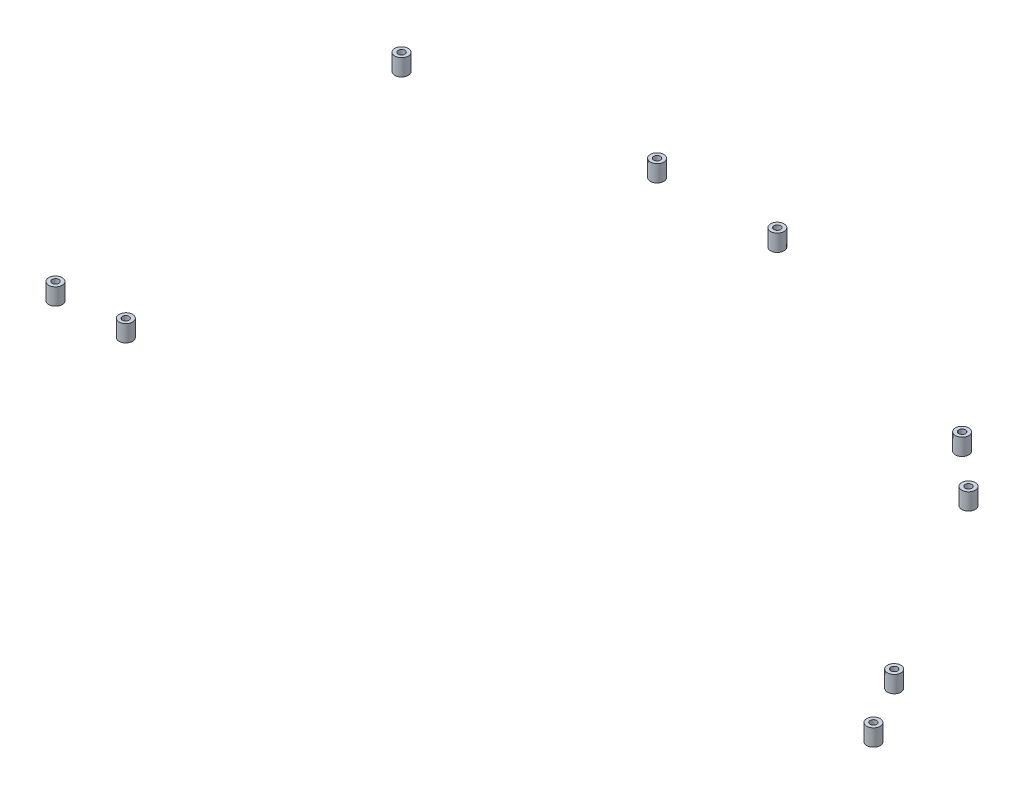
ISO-10303-21;
HEADER;
FILE_DESCRIPTION(('STEP AP214'),'2;1');
FILE_NAME('part.step','',(''),(''),'','','');
FILE_SCHEMA(('AUTOMOTIVE_DESIGN { 1 0 10303 214 1 1 1 1 }'));
ENDSEC;
DATA;
#1=APPLICATION_CONTEXT('core data for automotive mechanical design processes');
#2=APPLICATION_PROTOCOL_DEFINITION('international standard','automotive_design',2000,#1);
#3=PRODUCT_CONTEXT('',#1,'mechanical');
#4=PRODUCT('Part','Part','',(#3));
#5=PRODUCT_RELATED_PRODUCT_CATEGORY('part','',(#4));
#6=PRODUCT_DEFINITION_FORMATION('','',#4);
#7=PRODUCT_DEFINITION_CONTEXT('part definition',#1,'design');
#8=PRODUCT_DEFINITION('design','',#6,#7);
#9=PRODUCT_DEFINITION_SHAPE('','',#8);
#10=(LENGTH_UNIT() NAMED_UNIT(*) SI_UNIT(.MILLI.,.METRE.));
#11=(NAMED_UNIT(*) PLANE_ANGLE_UNIT() SI_UNIT($,.RADIAN.));
#12=(NAMED_UNIT(*) SI_UNIT($,.STERADIAN.) SOLID_ANGLE_UNIT());
#13=UNCERTAINTY_MEASURE_WITH_UNIT(LENGTH_MEASURE(1.E-05),#10,'distance_accuracy_value','');
#14=(GEOMETRIC_REPRESENTATION_CONTEXT(3) GLOBAL_UNCERTAINTY_ASSIGNED_CONTEXT((#13)) GLOBAL_UNIT_ASSIGNED_CONTEXT((#10,
#11,#12)) REPRESENTATION_CONTEXT('',''));
#15=CARTESIAN_POINT('',(0.,0.,0.));
#16=DIRECTION('',(0.,0.,1.));
#17=DIRECTION('',(1.,0.,0.));
#18=AXIS2_PLACEMENT_3D('',#15,#16,#17);
#19=CARTESIAN_POINT('',(-517.500474948423,435.000000002555,426.079389265339));
#20=DIRECTION('',(7.38219858506528E-12,1.,-2.03786987285071E-12));
#21=DIRECTION('',(-1.,7.38219858506528E-12,0.));
#22=AXIS2_PLACEMENT_3D('',#19,#20,#21);
#23=CYLINDRICAL_SURFACE('',#22,3.99999999983019);
#24=CARTESIAN_POINT('',(-517.500474948423,435.000000002563,430.079389265169));
#25=CARTESIAN_POINT('',(-509.500474948423,435.000000002504,430.079389265169));
#26=CARTESIAN_POINT('',(-509.500474948423,435.000000002488,422.079389265508));
#27=CARTESIAN_POINT('',(-517.500474948423,435.000000002547,422.079389265508));
#28=CARTESIAN_POINT('',(-525.500474948423,435.000000002606,422.079389265508));
#29=CARTESIAN_POINT('',(-525.500474948423,435.000000002622,430.079389265169));
#30=CARTESIAN_POINT('',(-517.500474948423,435.000000002563,430.079389265169));
#31=(BOUNDED_CURVE() B_SPLINE_CURVE(3,(#24,#25,#26,#27,#28,#29,#30),.UNSPECIFIED.,.T.,
.F.) B_SPLINE_CURVE_WITH_KNOTS((4,3,4),(0.,0.5,1.),
.UNSPECIFIED.) CURVE() GEOMETRIC_REPRESENTATION_ITEM() RATIONAL_B_SPLINE_CURVE((1.,
0.333333333333333,0.333333333333333,1.,0.333333333333333,0.333333333333333,1.)) REPRESENTATION_ITEM(''));
#32=CARTESIAN_POINT('',(-517.500474948423,435.000000002563,430.079389265169));
#33=VERTEX_POINT('',#32);
#34=EDGE_CURVE('E11',#33,#33,#31,.T.);
#35=ORIENTED_EDGE('',*,*,#34,.T.);
#36=EDGE_LOOP('',(#35));
#37=FACE_BOUND('',#36,.T.);
#38=CARTESIAN_POINT('',(-517.500474948349,445.000000002563,430.079389265148));
#39=CARTESIAN_POINT('',(-509.500474948349,445.000000002504,430.079389265148));
#40=CARTESIAN_POINT('',(-509.500474948349,445.000000002488,422.079389265488));
#41=CARTESIAN_POINT('',(-517.500474948349,445.000000002547,422.079389265488));
#42=CARTESIAN_POINT('',(-525.500474948349,445.000000002606,422.079389265488));
#43=CARTESIAN_POINT('',(-525.500474948349,445.000000002622,430.079389265148));
#44=CARTESIAN_POINT('',(-517.500474948349,445.000000002563,430.079389265148));
#45=(BOUNDED_CURVE() B_SPLINE_CURVE(3,(#38,#39,#40,#41,#42,#43,#44),.UNSPECIFIED.,.T.,
.F.) B_SPLINE_CURVE_WITH_KNOTS((4,3,4),(0.,0.5,1.),
.UNSPECIFIED.) CURVE() GEOMETRIC_REPRESENTATION_ITEM() RATIONAL_B_SPLINE_CURVE((1.,
0.333333333333333,0.333333333333333,1.,0.333333333333333,0.333333333333333,1.)) REPRESENTATION_ITEM(''));
#46=CARTESIAN_POINT('',(-517.500474948349,445.000000002563,430.079389265148));
#47=VERTEX_POINT('',#46);
#48=EDGE_CURVE('E45',#47,#47,#45,.T.);
#49=ORIENTED_EDGE('',*,*,#48,.F.);
#50=EDGE_LOOP('',(#49));
#51=FACE_BOUND('',#50,.T.);
#52=ADVANCED_FACE('F42',(#37,#51),#23,.T.);
#53=CARTESIAN_POINT('',(-517.500474948423,435.000000002547,422.079389265508));
#54=DIRECTION('',(-7.37604421985336E-12,-1.,2.04003480783533E-12));
#55=DIRECTION('',(1.,-7.37604421985336E-12,0.));
#56=AXIS2_PLACEMENT_3D('',#53,#54,#55);
#57=PLANE('',#56);
#58=CARTESIAN_POINT('',(-517.500474948423,435.000000002555,426.174740181992));
#59=DIRECTION('',(7.38219858506528E-12,1.,-2.03786987285071E-12));
#60=DIRECTION('',(-1.,7.38219858506528E-12,0.));
#61=AXIS2_PLACEMENT_3D('',#58,#59,#60);
#62=CIRCLE('',#61,2.);
#63=CARTESIAN_POINT('',(-519.500474948423,435.00000000257,426.174740181992));
#64=VERTEX_POINT('',#63);
#65=EDGE_CURVE('E54',#64,#64,#62,.T.);
#66=ORIENTED_EDGE('',*,*,#65,.T.);
#67=EDGE_LOOP('',(#66));
#68=FACE_BOUND('',#67,.T.);
#69=ORIENTED_EDGE('',*,*,#34,.F.);
#70=EDGE_LOOP('',(#69));
#71=FACE_BOUND('',#70,.T.);
#72=ADVANCED_FACE('F67',(#68,#71),#57,.T.);
#73=CARTESIAN_POINT('',(-517.500474948349,445.000000002547,422.079389265488));
#74=DIRECTION('',(-7.37604421985336E-12,-1.,2.04003480783533E-12));
#75=DIRECTION('',(1.,-7.37604421985336E-12,0.));
#76=AXIS2_PLACEMENT_3D('',#73,#74,#75);
#77=PLANE('',#76);
#78=CARTESIAN_POINT('',(-517.500474948349,445.000000002555,426.174740181972));
#79=DIRECTION('',(7.38219858506528E-12,1.,-2.03786987285071E-12));
#80=DIRECTION('',(-1.,7.38219858506528E-12,0.));
#81=AXIS2_PLACEMENT_3D('',#78,#79,#80);
#82=CIRCLE('',#81,2.);
#83=CARTESIAN_POINT('',(-519.500474948349,445.00000000257,426.174740181972));
#84=VERTEX_POINT('',#83);
#85=EDGE_CURVE('E58',#84,#84,#82,.T.);
#86=ORIENTED_EDGE('',*,*,#85,.F.);
#87=EDGE_LOOP('',(#86));
#88=FACE_BOUND('',#87,.T.);
#89=ORIENTED_EDGE('',*,*,#48,.T.);
#90=EDGE_LOOP('',(#89));
#91=FACE_BOUND('',#90,.T.);
#92=ADVANCED_FACE('F73',(#88,#91),#77,.F.);
#93=CARTESIAN_POINT('',(-517.500474948423,435.000000002555,426.174740181992));
#94=DIRECTION('',(7.38219858506528E-12,1.,-2.03786987285071E-12));
#95=DIRECTION('',(-1.,7.38219858506528E-12,0.));
#96=AXIS2_PLACEMENT_3D('',#93,#94,#95);
#97=CYLINDRICAL_SURFACE('',#96,2.);
#98=ORIENTED_EDGE('',*,*,#65,.F.);
#99=EDGE_LOOP('',(#98));
#100=FACE_BOUND('',#99,.T.);
#101=ORIENTED_EDGE('',*,*,#85,.T.);
#102=EDGE_LOOP('',(#101));
#103=FACE_BOUND('',#102,.T.);
#104=ADVANCED_FACE('F70',(#100,#103),#97,.F.);
#105=CLOSED_SHELL('',(#52,#72,#92,#104));
#106=MANIFOLD_SOLID_BREP('B2',#105);
#107=CARTESIAN_POINT('',(-557.500474948423,435.000000002854,428.07638853208));
#108=DIRECTION('',(7.38219858506528E-12,1.,-2.03786987285071E-12));
#109=DIRECTION('',(-1.,7.38219858506528E-12,0.));
#110=AXIS2_PLACEMENT_3D('',#107,#108,#109);
#111=CYLINDRICAL_SURFACE('',#110,3.99999999983019);
#112=CARTESIAN_POINT('',(-557.500474948423,435.000000002862,432.07638853191));
#113=CARTESIAN_POINT('',(-549.500474948423,435.000000002803,432.07638853191));
#114=CARTESIAN_POINT('',(-549.500474948423,435.000000002787,424.07638853225));
#115=CARTESIAN_POINT('',(-557.500474948423,435.000000002846,424.07638853225));
#116=CARTESIAN_POINT('',(-565.500474948423,435.000000002905,424.07638853225));
#117=CARTESIAN_POINT('',(-565.500474948423,435.000000002921,432.07638853191));
#118=CARTESIAN_POINT('',(-557.500474948423,435.000000002862,432.07638853191));
#119=(BOUNDED_CURVE() B_SPLINE_CURVE(3,(#112,#113,#114,#115,#116,#117,#118),.UNSPECIFIED.,.T.,
.F.) B_SPLINE_CURVE_WITH_KNOTS((4,3,4),(0.,0.5,1.),
.UNSPECIFIED.) CURVE() GEOMETRIC_REPRESENTATION_ITEM() RATIONAL_B_SPLINE_CURVE((1.,
0.333333333333333,0.333333333333333,1.,0.333333333333333,0.333333333333333,1.)) REPRESENTATION_ITEM(''));
#120=CARTESIAN_POINT('',(-557.500474948423,435.000000002862,432.07638853191));
#121=VERTEX_POINT('',#120);
#122=EDGE_CURVE('E41',#121,#121,#119,.T.);
#123=ORIENTED_EDGE('',*,*,#122,.T.);
#124=EDGE_LOOP('',(#123));
#125=FACE_BOUND('',#124,.T.);
#126=CARTESIAN_POINT('',(-557.500474948349,445.000000002862,432.07638853189));
#127=CARTESIAN_POINT('',(-549.500474948349,445.000000002803,432.07638853189));
#128=CARTESIAN_POINT('',(-549.500474948349,445.000000002787,424.076388532229));
#129=CARTESIAN_POINT('',(-557.500474948349,445.000000002846,424.076388532229));
#130=CARTESIAN_POINT('',(-565.500474948349,445.000000002905,424.076388532229));
#131=CARTESIAN_POINT('',(-565.500474948349,445.000000002921,432.07638853189));
#132=CARTESIAN_POINT('',(-557.500474948349,445.000000002862,432.07638853189));
#133=(BOUNDED_CURVE() B_SPLINE_CURVE(3,(#126,#127,#128,#129,#130,#131,#132),.UNSPECIFIED.,.T.,
.F.) B_SPLINE_CURVE_WITH_KNOTS((4,3,4),(0.,0.5,1.),
.UNSPECIFIED.) CURVE() GEOMETRIC_REPRESENTATION_ITEM() RATIONAL_B_SPLINE_CURVE((1.,
0.333333333333333,0.333333333333333,1.,0.333333333333333,0.333333333333333,1.)) REPRESENTATION_ITEM(''));
#134=CARTESIAN_POINT('',(-557.500474948349,445.000000002862,432.07638853189));
#135=VERTEX_POINT('',#134);
#136=EDGE_CURVE('E125',#135,#135,#133,.T.);
#137=ORIENTED_EDGE('',*,*,#136,.F.);
#138=EDGE_LOOP('',(#137));
#139=FACE_BOUND('',#138,.T.);
#140=ADVANCED_FACE('F122',(#125,#139),#111,.T.);
#141=CARTESIAN_POINT('',(-557.500474948423,435.000000002846,424.07638853225));
#142=DIRECTION('',(-7.37604421985338E-12,-1.,2.04003480783533E-12));
#143=DIRECTION('',(1.,-7.37604421985338E-12,0.));
#144=AXIS2_PLACEMENT_3D('',#141,#142,#143);
#145=PLANE('',#144);
#146=CARTESIAN_POINT('',(-557.500474948423,435.000000002854,428.045174827121));
#147=DIRECTION('',(7.38219858506528E-12,1.,-2.03786987285071E-12));
#148=DIRECTION('',(-1.,7.38219858506528E-12,0.));
#149=AXIS2_PLACEMENT_3D('',#146,#147,#148);
#150=CIRCLE('',#149,2.);
#151=CARTESIAN_POINT('',(-559.500474948423,435.000000002869,428.045174827121));
#152=VERTEX_POINT('',#151);
#153=EDGE_CURVE('E134',#152,#152,#150,.T.);
#154=ORIENTED_EDGE('',*,*,#153,.T.);
#155=EDGE_LOOP('',(#154));
#156=FACE_BOUND('',#155,.T.);
#157=ORIENTED_EDGE('',*,*,#122,.F.);
#158=EDGE_LOOP('',(#157));
#159=FACE_BOUND('',#158,.T.);
#160=ADVANCED_FACE('F147',(#156,#159),#145,.T.);
#161=CARTESIAN_POINT('',(-557.500474948349,445.000000002846,424.076388532229));
#162=DIRECTION('',(-7.37604421985338E-12,-1.,2.04003480783533E-12));
#163=DIRECTION('',(1.,-7.37604421985338E-12,0.));
#164=AXIS2_PLACEMENT_3D('',#161,#162,#163);
#165=PLANE('',#164);
#166=CARTESIAN_POINT('',(-557.500474948349,445.000000002854,428.0451748271));
#167=DIRECTION('',(7.38219858506528E-12,1.,-2.03786987285071E-12));
#168=DIRECTION('',(-1.,7.38219858506528E-12,0.));
#169=AXIS2_PLACEMENT_3D('',#166,#167,#168);
#170=CIRCLE('',#169,2.);
#171=CARTESIAN_POINT('',(-559.500474948349,445.000000002869,428.0451748271));
#172=VERTEX_POINT('',#171);
#173=EDGE_CURVE('E138',#172,#172,#170,.T.);
#174=ORIENTED_EDGE('',*,*,#173,.F.);
#175=EDGE_LOOP('',(#174));
#176=FACE_BOUND('',#175,.T.);
#177=ORIENTED_EDGE('',*,*,#136,.T.);
#178=EDGE_LOOP('',(#177));
#179=FACE_BOUND('',#178,.T.);
#180=ADVANCED_FACE('F153',(#176,#179),#165,.F.);
#181=CARTESIAN_POINT('',(-557.500474948423,435.000000002854,428.045174827121));
#182=DIRECTION('',(7.38219858506528E-12,1.,-2.03786987285071E-12));
#183=DIRECTION('',(-1.,7.38219858506528E-12,0.));
#184=AXIS2_PLACEMENT_3D('',#181,#182,#183);
#185=CYLINDRICAL_SURFACE('',#184,2.);
#186=ORIENTED_EDGE('',*,*,#153,.F.);
#187=EDGE_LOOP('',(#186));
#188=FACE_BOUND('',#187,.T.);
#189=ORIENTED_EDGE('',*,*,#173,.T.);
#190=EDGE_LOOP('',(#189));
#191=FACE_BOUND('',#190,.T.);
#192=ADVANCED_FACE('F150',(#188,#191),#185,.F.);
#193=CLOSED_SHELL('',(#140,#160,#180,#192));
#194=MANIFOLD_SOLID_BREP('B6',#193);
#195=CARTESIAN_POINT('',(-85.5135337310011,434.999999999337,411.920534849134));
#196=DIRECTION('',(7.38219858506528E-12,1.,-2.03786987285071E-12));
#197=DIRECTION('',(-1.,7.38219858506528E-12,0.));
#198=AXIS2_PLACEMENT_3D('',#195,#196,#197);
#199=CYLINDRICAL_SURFACE('',#198,3.9999999999216);
#200=CARTESIAN_POINT('',(-85.5135337310011,434.999999999337,411.920534849134));
#201=DIRECTION('',(7.38219858506528E-12,1.,-2.03786987285071E-12));
#202=DIRECTION('',(-1.,7.38219858506528E-12,0.));
#203=AXIS2_PLACEMENT_3D('',#200,#201,#202);
#204=CIRCLE('',#203,3.9999999999216);
#205=CARTESIAN_POINT('',(-89.5135337309227,434.999999999366,411.920534849134));
#206=VERTEX_POINT('',#205);
#207=EDGE_CURVE('E121',#206,#206,#204,.T.);
#208=ORIENTED_EDGE('',*,*,#207,.T.);
#209=EDGE_LOOP('',(#208));
#210=FACE_BOUND('',#209,.T.);
#211=CARTESIAN_POINT('',(-85.5135337309273,444.999999999337,411.920534849114));
#212=DIRECTION('',(7.38219858506528E-12,1.,-2.03786987285071E-12));
#213=DIRECTION('',(-1.,7.38219858506528E-12,0.));
#214=AXIS2_PLACEMENT_3D('',#211,#212,#213);
#215=CIRCLE('',#214,3.9999999999216);
#216=CARTESIAN_POINT('',(-89.5135337308489,444.999999999366,411.920534849114));
#217=VERTEX_POINT('',#216);
#218=EDGE_CURVE('E205',#217,#217,#215,.T.);
#219=ORIENTED_EDGE('',*,*,#218,.F.);
#220=EDGE_LOOP('',(#219));
#221=FACE_BOUND('',#220,.T.);
#222=ADVANCED_FACE('F202',(#210,#221),#199,.T.);
#223=CARTESIAN_POINT('',(-85.5135337310011,434.999999999337,411.920534849134));
#224=DIRECTION('',(7.38219858506528E-12,1.,-2.03786987285071E-12));
#225=DIRECTION('',(-1.,7.38219858506528E-12,0.));
#226=AXIS2_PLACEMENT_3D('',#223,#224,#225);
#227=PLANE('',#226);
#228=CARTESIAN_POINT('',(-85.5135337310011,434.999999999337,411.920534849134));
#229=DIRECTION('',(7.38219858506528E-12,1.,-2.03786987285071E-12));
#230=DIRECTION('',(-1.,7.38219858506528E-12,0.));
#231=AXIS2_PLACEMENT_3D('',#228,#229,#230);
#232=CIRCLE('',#231,2.);
#233=CARTESIAN_POINT('',(-87.5135337310011,434.999999999352,411.920534849134));
#234=VERTEX_POINT('',#233);
#235=EDGE_CURVE('E212',#234,#234,#232,.T.);
#236=ORIENTED_EDGE('',*,*,#235,.T.);
#237=EDGE_LOOP('',(#236));
#238=FACE_BOUND('',#237,.T.);
#239=ORIENTED_EDGE('',*,*,#207,.F.);
#240=EDGE_LOOP('',(#239));
#241=FACE_BOUND('',#240,.T.);
#242=ADVANCED_FACE('F220',(#238,#241),#227,.F.);
#243=CARTESIAN_POINT('',(-85.5135337309273,444.999999999337,411.920534849114));
#244=DIRECTION('',(7.38219858506528E-12,1.,-2.03786987285071E-12));
#245=DIRECTION('',(-1.,7.38219858506528E-12,0.));
#246=AXIS2_PLACEMENT_3D('',#243,#244,#245);
#247=PLANE('',#246);
#248=CARTESIAN_POINT('',(-85.5135337309273,444.999999999337,411.920534849114));
#249=DIRECTION('',(7.38219858506528E-12,1.,-2.03786987285071E-12));
#250=DIRECTION('',(-1.,7.38219858506528E-12,0.));
#251=AXIS2_PLACEMENT_3D('',#248,#249,#250);
#252=CIRCLE('',#251,2.);
#253=CARTESIAN_POINT('',(-87.5135337309273,444.999999999352,411.920534849114));
#254=VERTEX_POINT('',#253);
#255=EDGE_CURVE('E214',#254,#254,#252,.T.);
#256=ORIENTED_EDGE('',*,*,#255,.F.);
#257=EDGE_LOOP('',(#256));
#258=FACE_BOUND('',#257,.T.);
#259=ORIENTED_EDGE('',*,*,#218,.T.);
#260=EDGE_LOOP('',(#259));
#261=FACE_BOUND('',#260,.T.);
#262=ADVANCED_FACE('F226',(#258,#261),#247,.T.);
#263=CARTESIAN_POINT('',(-85.5135337310011,434.999999999337,411.920534849134));
#264=DIRECTION('',(7.38219858506528E-12,1.,-2.03786987285071E-12));
#265=DIRECTION('',(-1.,7.38219858506528E-12,0.));
#266=AXIS2_PLACEMENT_3D('',#263,#264,#265);
#267=CYLINDRICAL_SURFACE('',#266,2.);
#268=ORIENTED_EDGE('',*,*,#235,.F.);
#269=EDGE_LOOP('',(#268));
#270=FACE_BOUND('',#269,.T.);
#271=ORIENTED_EDGE('',*,*,#255,.T.);
#272=EDGE_LOOP('',(#271));
#273=FACE_BOUND('',#272,.T.);
#274=ADVANCED_FACE('F223',(#270,#273),#267,.F.);
#275=CLOSED_SHELL('',(#222,#242,#262,#274));
#276=MANIFOLD_SOLID_BREP('B36',#275);
#277=CARTESIAN_POINT('',(-106.941386536483,434.999999999426,378.144106320549));
#278=DIRECTION('',(7.38219858506528E-12,1.,-2.03786987285071E-12));
#279=DIRECTION('',(-1.,7.38219858506528E-12,0.));
#280=AXIS2_PLACEMENT_3D('',#277,#278,#279);
#281=CYLINDRICAL_SURFACE('',#280,3.99999999992193);
#282=CARTESIAN_POINT('',(-106.941386536483,434.999999999426,378.144106320549));
#283=DIRECTION('',(7.38219858506528E-12,1.,-2.03786987285071E-12));
#284=DIRECTION('',(-1.,7.38219858506528E-12,0.));
#285=AXIS2_PLACEMENT_3D('',#282,#283,#284);
#286=CIRCLE('',#285,3.99999999992193);
#287=CARTESIAN_POINT('',(-110.941386536405,434.999999999456,378.144106320549));
#288=VERTEX_POINT('',#287);
#289=EDGE_CURVE('E201',#288,#288,#286,.T.);
#290=ORIENTED_EDGE('',*,*,#289,.T.);
#291=EDGE_LOOP('',(#290));
#292=FACE_BOUND('',#291,.T.);
#293=CARTESIAN_POINT('',(-106.941386536409,444.999999999426,378.144106320529));
#294=DIRECTION('',(7.38219858506528E-12,1.,-2.03786987285071E-12));
#295=DIRECTION('',(-1.,7.38219858506528E-12,0.));
#296=AXIS2_PLACEMENT_3D('',#293,#294,#295);
#297=CIRCLE('',#296,3.99999999992193);
#298=CARTESIAN_POINT('',(-110.941386536331,444.999999999456,378.144106320529));
#299=VERTEX_POINT('',#298);
#300=EDGE_CURVE('E275',#299,#299,#297,.T.);
#301=ORIENTED_EDGE('',*,*,#300,.F.);
#302=EDGE_LOOP('',(#301));
#303=FACE_BOUND('',#302,.T.);
#304=ADVANCED_FACE('F272',(#292,#303),#281,.T.);
#305=CARTESIAN_POINT('',(-106.941386536483,434.999999999426,378.144106320549));
#306=DIRECTION('',(7.38219858506528E-12,1.,-2.03786987285071E-12));
#307=DIRECTION('',(-1.,7.38219858506528E-12,0.));
#308=AXIS2_PLACEMENT_3D('',#305,#306,#307);
#309=PLANE('',#308);
#310=CARTESIAN_POINT('',(-106.941386536483,434.999999999426,378.144106320549));
#311=DIRECTION('',(7.38219858506528E-12,1.,-2.03786987285071E-12));
#312=DIRECTION('',(-1.,7.38219858506528E-12,0.));
#313=AXIS2_PLACEMENT_3D('',#310,#311,#312);
#314=CIRCLE('',#313,2.);
#315=CARTESIAN_POINT('',(-108.941386536483,434.999999999441,378.144106320549));
#316=VERTEX_POINT('',#315);
#317=EDGE_CURVE('E282',#316,#316,#314,.T.);
#318=ORIENTED_EDGE('',*,*,#317,.T.);
#319=EDGE_LOOP('',(#318));
#320=FACE_BOUND('',#319,.T.);
#321=ORIENTED_EDGE('',*,*,#289,.F.);
#322=EDGE_LOOP('',(#321));
#323=FACE_BOUND('',#322,.T.);
#324=ADVANCED_FACE('F290',(#320,#323),#309,.F.);
#325=CARTESIAN_POINT('',(-106.941386536409,444.999999999426,378.144106320529));
#326=DIRECTION('',(7.38219858506528E-12,1.,-2.03786987285071E-12));
#327=DIRECTION('',(-1.,7.38219858506528E-12,0.));
#328=AXIS2_PLACEMENT_3D('',#325,#326,#327);
#329=PLANE('',#328);
#330=CARTESIAN_POINT('',(-106.941386536409,444.999999999426,378.144106320529));
#331=DIRECTION('',(7.38219858506528E-12,1.,-2.03786987285071E-12));
#332=DIRECTION('',(-1.,7.38219858506528E-12,0.));
#333=AXIS2_PLACEMENT_3D('',#330,#331,#332);
#334=CIRCLE('',#333,2.);
#335=CARTESIAN_POINT('',(-108.941386536409,444.999999999441,378.144106320529));
#336=VERTEX_POINT('',#335);
#337=EDGE_CURVE('E284',#336,#336,#334,.T.);
#338=ORIENTED_EDGE('',*,*,#337,.F.);
#339=EDGE_LOOP('',(#338));
#340=FACE_BOUND('',#339,.T.);
#341=ORIENTED_EDGE('',*,*,#300,.T.);
#342=EDGE_LOOP('',(#341));
#343=FACE_BOUND('',#342,.T.);
#344=ADVANCED_FACE('F296',(#340,#343),#329,.T.);
#345=CARTESIAN_POINT('',(-106.941386536483,434.999999999426,378.144106320549));
#346=DIRECTION('',(7.38219858506528E-12,1.,-2.03786987285071E-12));
#347=DIRECTION('',(-1.,7.38219858506528E-12,0.));
#348=AXIS2_PLACEMENT_3D('',#345,#346,#347);
#349=CYLINDRICAL_SURFACE('',#348,2.);
#350=ORIENTED_EDGE('',*,*,#317,.F.);
#351=EDGE_LOOP('',(#350));
#352=FACE_BOUND('',#351,.T.);
#353=ORIENTED_EDGE('',*,*,#337,.T.);
#354=EDGE_LOOP('',(#353));
#355=FACE_BOUND('',#354,.T.);
#356=ADVANCED_FACE('F293',(#352,#355),#349,.F.);
#357=CLOSED_SHELL('',(#304,#324,#344,#356));
#358=MANIFOLD_SOLID_BREP('B116',#357);
#359=CARTESIAN_POINT('',(-179.166238959109,434.999999999722,261.544556892225));
#360=DIRECTION('',(7.38219858506528E-12,1.,-2.03786987285071E-12));
#361=DIRECTION('',(-1.,7.38219858506528E-12,0.));
#362=AXIS2_PLACEMENT_3D('',#359,#360,#361);
#363=CYLINDRICAL_SURFACE('',#362,3.99999999925616);
#364=CARTESIAN_POINT('',(-179.166238959109,434.999999999722,261.544556892225));
#365=DIRECTION('',(7.38219858506528E-12,1.,-2.03786987285071E-12));
#366=DIRECTION('',(-1.,7.38219858506528E-12,0.));
#367=AXIS2_PLACEMENT_3D('',#364,#365,#366);
#368=CIRCLE('',#367,3.99999999925616);
#369=CARTESIAN_POINT('',(-183.166238958365,434.999999999751,261.544556892225));
#370=VERTEX_POINT('',#369);
#371=EDGE_CURVE('E271',#370,#370,#368,.T.);
#372=ORIENTED_EDGE('',*,*,#371,.T.);
#373=EDGE_LOOP('',(#372));
#374=FACE_BOUND('',#373,.T.);
#375=CARTESIAN_POINT('',(-179.166238959035,444.999999999722,261.544556892205));
#376=DIRECTION('',(7.38219858506528E-12,1.,-2.03786987285071E-12));
#377=DIRECTION('',(-1.,7.38219858506528E-12,0.));
#378=AXIS2_PLACEMENT_3D('',#375,#376,#377);
#379=CIRCLE('',#378,3.99999999925616);
#380=CARTESIAN_POINT('',(-183.166238958291,444.999999999751,261.544556892205));
#381=VERTEX_POINT('',#380);
#382=EDGE_CURVE('E345',#381,#381,#379,.T.);
#383=ORIENTED_EDGE('',*,*,#382,.F.);
#384=EDGE_LOOP('',(#383));
#385=FACE_BOUND('',#384,.T.);
#386=ADVANCED_FACE('F342',(#374,#385),#363,.T.);
#387=CARTESIAN_POINT('',(-179.166238959109,434.999999999722,261.544556892225));
#388=DIRECTION('',(7.38219858506528E-12,1.,-2.03786987285071E-12));
#389=DIRECTION('',(-1.,7.38219858506528E-12,0.));
#390=AXIS2_PLACEMENT_3D('',#387,#388,#389);
#391=PLANE('',#390);
#392=CARTESIAN_POINT('',(-179.166238959109,434.999999999722,261.544556892225));
#393=DIRECTION('',(7.38219858506528E-12,1.,-2.03786987285071E-12));
#394=DIRECTION('',(-1.,7.38219858506528E-12,0.));
#395=AXIS2_PLACEMENT_3D('',#392,#393,#394);
#396=CIRCLE('',#395,2.);
#397=CARTESIAN_POINT('',(-181.166238959109,434.999999999737,261.544556892225));
#398=VERTEX_POINT('',#397);
#399=EDGE_CURVE('E352',#398,#398,#396,.T.);
#400=ORIENTED_EDGE('',*,*,#399,.T.);
#401=EDGE_LOOP('',(#400));
#402=FACE_BOUND('',#401,.T.);
#403=ORIENTED_EDGE('',*,*,#371,.F.);
#404=EDGE_LOOP('',(#403));
#405=FACE_BOUND('',#404,.T.);
#406=ADVANCED_FACE('F360',(#402,#405),#391,.F.);
#407=CARTESIAN_POINT('',(-179.166238959035,444.999999999722,261.544556892205));
#408=DIRECTION('',(7.38219858506528E-12,1.,-2.03786987285071E-12));
#409=DIRECTION('',(-1.,7.38219858506528E-12,0.));
#410=AXIS2_PLACEMENT_3D('',#407,#408,#409);
#411=PLANE('',#410);
#412=CARTESIAN_POINT('',(-179.166238959035,444.999999999722,261.544556892205));
#413=DIRECTION('',(7.38219858506528E-12,1.,-2.03786987285071E-12));
#414=DIRECTION('',(-1.,7.38219858506528E-12,0.));
#415=AXIS2_PLACEMENT_3D('',#412,#413,#414);
#416=CIRCLE('',#415,2.);
#417=CARTESIAN_POINT('',(-181.166238959035,444.999999999737,261.544556892205));
#418=VERTEX_POINT('',#417);
#419=EDGE_CURVE('E354',#418,#418,#416,.T.);
#420=ORIENTED_EDGE('',*,*,#419,.F.);
#421=EDGE_LOOP('',(#420));
#422=FACE_BOUND('',#421,.T.);
#423=ORIENTED_EDGE('',*,*,#382,.T.);
#424=EDGE_LOOP('',(#423));
#425=FACE_BOUND('',#424,.T.);
#426=ADVANCED_FACE('F366',(#422,#425),#411,.T.);
#427=CARTESIAN_POINT('',(-179.166238959109,434.999999999722,261.544556892225));
#428=DIRECTION('',(7.38219858506528E-12,1.,-2.03786987285071E-12));
#429=DIRECTION('',(-1.,7.38219858506528E-12,0.));
#430=AXIS2_PLACEMENT_3D('',#427,#428,#429);
#431=CYLINDRICAL_SURFACE('',#430,2.);
#432=ORIENTED_EDGE('',*,*,#399,.F.);
#433=EDGE_LOOP('',(#432));
#434=FACE_BOUND('',#433,.T.);
#435=ORIENTED_EDGE('',*,*,#419,.T.);
#436=EDGE_LOOP('',(#435));
#437=FACE_BOUND('',#436,.T.);
#438=ADVANCED_FACE('F363',(#434,#437),#431,.F.);
#439=CLOSED_SHELL('',(#386,#406,#426,#438));
#440=MANIFOLD_SOLID_BREP('B196',#439);
#441=CARTESIAN_POINT('',(-209.294177746805,434.999999999891,235.232823684304));
#442=DIRECTION('',(7.38219858506528E-12,1.,-2.03786987285071E-12));
#443=DIRECTION('',(-1.,7.38219858506528E-12,0.));
#444=AXIS2_PLACEMENT_3D('',#441,#442,#443);
#445=CYLINDRICAL_SURFACE('',#444,3.99999999925617);
#446=CARTESIAN_POINT('',(-209.294177746805,434.999999999891,235.232823684304));
#447=DIRECTION('',(7.38219858506528E-12,1.,-2.03786987285071E-12));
#448=DIRECTION('',(-1.,7.38219858506528E-12,0.));
#449=AXIS2_PLACEMENT_3D('',#446,#447,#448);
#450=CIRCLE('',#449,3.99999999925617);
#451=CARTESIAN_POINT('',(-213.294177746061,434.99999999992,235.232823684304));
#452=VERTEX_POINT('',#451);
#453=EDGE_CURVE('E341',#452,#452,#450,.T.);
#454=ORIENTED_EDGE('',*,*,#453,.T.);
#455=EDGE_LOOP('',(#454));
#456=FACE_BOUND('',#455,.T.);
#457=CARTESIAN_POINT('',(-209.294177746731,444.999999999891,235.232823684283));
#458=DIRECTION('',(7.38219858506528E-12,1.,-2.03786987285071E-12));
#459=DIRECTION('',(-1.,7.38219858506528E-12,0.));
#460=AXIS2_PLACEMENT_3D('',#457,#458,#459);
#461=CIRCLE('',#460,3.99999999925617);
#462=CARTESIAN_POINT('',(-213.294177745988,444.99999999992,235.232823684283));
#463=VERTEX_POINT('',#462);
#464=EDGE_CURVE('E415',#463,#463,#461,.T.);
#465=ORIENTED_EDGE('',*,*,#464,.F.);
#466=EDGE_LOOP('',(#465));
#467=FACE_BOUND('',#466,.T.);
#468=ADVANCED_FACE('F412',(#456,#467),#445,.T.);
#469=CARTESIAN_POINT('',(-209.294177746805,434.999999999891,235.232823684304));
#470=DIRECTION('',(7.38219858506528E-12,1.,-2.03786987285071E-12));
#471=DIRECTION('',(-1.,7.38219858506528E-12,0.));
#472=AXIS2_PLACEMENT_3D('',#469,#470,#471);
#473=PLANE('',#472);
#474=CARTESIAN_POINT('',(-209.294177746805,434.999999999891,235.232823684304));
#475=DIRECTION('',(7.38219858506528E-12,1.,-2.03786987285071E-12));
#476=DIRECTION('',(-1.,7.38219858506528E-12,0.));
#477=AXIS2_PLACEMENT_3D('',#474,#475,#476);
#478=CIRCLE('',#477,2.);
#479=CARTESIAN_POINT('',(-211.294177746805,434.999999999905,235.232823684304));
#480=VERTEX_POINT('',#479);
#481=EDGE_CURVE('E422',#480,#480,#478,.T.);
#482=ORIENTED_EDGE('',*,*,#481,.T.);
#483=EDGE_LOOP('',(#482));
#484=FACE_BOUND('',#483,.T.);
#485=ORIENTED_EDGE('',*,*,#453,.F.);
#486=EDGE_LOOP('',(#485));
#487=FACE_BOUND('',#486,.T.);
#488=ADVANCED_FACE('F430',(#484,#487),#473,.F.);
#489=CARTESIAN_POINT('',(-209.294177746731,444.999999999891,235.232823684283));
#490=DIRECTION('',(7.38219858506528E-12,1.,-2.03786987285071E-12));
#491=DIRECTION('',(-1.,7.38219858506528E-12,0.));
#492=AXIS2_PLACEMENT_3D('',#489,#490,#491);
#493=PLANE('',#492);
#494=CARTESIAN_POINT('',(-209.294177746731,444.999999999891,235.232823684283));
#495=DIRECTION('',(7.38219858506528E-12,1.,-2.03786987285071E-12));
#496=DIRECTION('',(-1.,7.38219858506528E-12,0.));
#497=AXIS2_PLACEMENT_3D('',#494,#495,#496);
#498=CIRCLE('',#497,2.);
#499=CARTESIAN_POINT('',(-211.294177746731,444.999999999905,235.232823684283));
#500=VERTEX_POINT('',#499);
#501=EDGE_CURVE('E424',#500,#500,#498,.T.);
#502=ORIENTED_EDGE('',*,*,#501,.F.);
#503=EDGE_LOOP('',(#502));
#504=FACE_BOUND('',#503,.T.);
#505=ORIENTED_EDGE('',*,*,#464,.T.);
#506=EDGE_LOOP('',(#505));
#507=FACE_BOUND('',#506,.T.);
#508=ADVANCED_FACE('F436',(#504,#507),#493,.T.);
#509=CARTESIAN_POINT('',(-209.294177746805,434.999999999891,235.232823684304));
#510=DIRECTION('',(7.38219858506528E-12,1.,-2.03786987285071E-12));
#511=DIRECTION('',(-1.,7.38219858506528E-12,0.));
#512=AXIS2_PLACEMENT_3D('',#509,#510,#511);
#513=CYLINDRICAL_SURFACE('',#512,2.);
#514=ORIENTED_EDGE('',*,*,#481,.F.);
#515=EDGE_LOOP('',(#514));
#516=FACE_BOUND('',#515,.T.);
#517=ORIENTED_EDGE('',*,*,#501,.T.);
#518=EDGE_LOOP('',(#517));
#519=FACE_BOUND('',#518,.T.);
#520=ADVANCED_FACE('F433',(#516,#519),#513,.F.);
#521=CLOSED_SHELL('',(#468,#488,#508,#520));
#522=MANIFOLD_SOLID_BREP('B266',#521);
#523=CARTESIAN_POINT('',(-369.907883248338,435.000000000974,184.906368668648));
#524=DIRECTION('',(7.38219858506528E-12,1.,-2.03786987285071E-12));
#525=DIRECTION('',(-1.,7.38219858506528E-12,0.));
#526=AXIS2_PLACEMENT_3D('',#523,#524,#525);
#527=CYLINDRICAL_SURFACE('',#526,3.99999999999999);
#528=CARTESIAN_POINT('',(-369.907883248338,435.000000000974,184.906368668648));
#529=DIRECTION('',(7.38219858506528E-12,1.,-2.03786987285071E-12));
#530=DIRECTION('',(-1.,7.38219858506528E-12,0.));
#531=AXIS2_PLACEMENT_3D('',#528,#529,#530);
#532=CIRCLE('',#531,3.99999999999999);
#533=CARTESIAN_POINT('',(-373.907883248338,435.000000001003,184.906368668648));
#534=VERTEX_POINT('',#533);
#535=EDGE_CURVE('E411',#534,#534,#532,.T.);
#536=ORIENTED_EDGE('',*,*,#535,.T.);
#537=EDGE_LOOP('',(#536));
#538=FACE_BOUND('',#537,.T.);
#539=CARTESIAN_POINT('',(-369.907883248264,445.000000000974,184.906368668627));
#540=DIRECTION('',(7.38219858506528E-12,1.,-2.03786987285071E-12));
#541=DIRECTION('',(-1.,7.38219858506528E-12,0.));
#542=AXIS2_PLACEMENT_3D('',#539,#540,#541);
#543=CIRCLE('',#542,3.99999999999999);
#544=CARTESIAN_POINT('',(-373.907883248264,445.000000001003,184.906368668627));
#545=VERTEX_POINT('',#544);
#546=EDGE_CURVE('E485',#545,#545,#543,.T.);
#547=ORIENTED_EDGE('',*,*,#546,.F.);
#548=EDGE_LOOP('',(#547));
#549=FACE_BOUND('',#548,.T.);
#550=ADVANCED_FACE('F482',(#538,#549),#527,.T.);
#551=CARTESIAN_POINT('',(-369.907883248338,435.000000000974,184.906368668648));
#552=DIRECTION('',(7.38219858506528E-12,1.,-2.03786987285071E-12));
#553=DIRECTION('',(-1.,7.38219858506528E-12,0.));
#554=AXIS2_PLACEMENT_3D('',#551,#552,#553);
#555=PLANE('',#554);
#556=CARTESIAN_POINT('',(-369.907883248338,435.000000000974,184.906368668648));
#557=DIRECTION('',(7.38219858506528E-12,1.,-2.03786987285071E-12));
#558=DIRECTION('',(-1.,7.38219858506528E-12,0.));
#559=AXIS2_PLACEMENT_3D('',#556,#557,#558);
#560=CIRCLE('',#559,2.);
#561=CARTESIAN_POINT('',(-371.907883248338,435.000000000989,184.906368668648));
#562=VERTEX_POINT('',#561);
#563=EDGE_CURVE('E492',#562,#562,#560,.T.);
#564=ORIENTED_EDGE('',*,*,#563,.T.);
#565=EDGE_LOOP('',(#564));
#566=FACE_BOUND('',#565,.T.);
#567=ORIENTED_EDGE('',*,*,#535,.F.);
#568=EDGE_LOOP('',(#567));
#569=FACE_BOUND('',#568,.T.);
#570=ADVANCED_FACE('F500',(#566,#569),#555,.F.);
#571=CARTESIAN_POINT('',(-369.907883248264,445.000000000974,184.906368668627));
#572=DIRECTION('',(7.38219858506528E-12,1.,-2.03786987285071E-12));
#573=DIRECTION('',(-1.,7.38219858506528E-12,0.));
#574=AXIS2_PLACEMENT_3D('',#571,#572,#573);
#575=PLANE('',#574);
#576=CARTESIAN_POINT('',(-369.907883248264,445.000000000974,184.906368668627));
#577=DIRECTION('',(7.38219858506528E-12,1.,-2.03786987285071E-12));
#578=DIRECTION('',(-1.,7.38219858506528E-12,0.));
#579=AXIS2_PLACEMENT_3D('',#576,#577,#578);
#580=CIRCLE('',#579,2.);
#581=CARTESIAN_POINT('',(-371.907883248264,445.000000000989,184.906368668627));
#582=VERTEX_POINT('',#581);
#583=EDGE_CURVE('E494',#582,#582,#580,.T.);
#584=ORIENTED_EDGE('',*,*,#583,.F.);
#585=EDGE_LOOP('',(#584));
#586=FACE_BOUND('',#585,.T.);
#587=ORIENTED_EDGE('',*,*,#546,.T.);
#588=EDGE_LOOP('',(#587));
#589=FACE_BOUND('',#588,.T.);
#590=ADVANCED_FACE('F506',(#586,#589),#575,.T.);
#591=CARTESIAN_POINT('',(-369.907883248338,435.000000000974,184.906368668648));
#592=DIRECTION('',(7.38219858506528E-12,1.,-2.03786987285071E-12));
#593=DIRECTION('',(-1.,7.38219858506528E-12,0.));
#594=AXIS2_PLACEMENT_3D('',#591,#592,#593);
#595=CYLINDRICAL_SURFACE('',#594,2.);
#596=ORIENTED_EDGE('',*,*,#563,.F.);
#597=EDGE_LOOP('',(#596));
#598=FACE_BOUND('',#597,.T.);
#599=ORIENTED_EDGE('',*,*,#583,.T.);
#600=EDGE_LOOP('',(#599));
#601=FACE_BOUND('',#600,.T.);
#602=ADVANCED_FACE('F503',(#598,#601),#595,.F.);
#603=CLOSED_SHELL('',(#550,#570,#590,#602));
#604=MANIFOLD_SOLID_BREP('B336',#603);
#605=CARTESIAN_POINT('',(-441.663717109634,435.000000001503,184.906368668622));
#606=DIRECTION('',(7.38219858506528E-12,1.,-2.03786987285071E-12));
#607=DIRECTION('',(-1.,7.38219858506528E-12,0.));
#608=AXIS2_PLACEMENT_3D('',#605,#606,#607);
#609=CYLINDRICAL_SURFACE('',#608,3.99999999999999);
#610=CARTESIAN_POINT('',(-441.663717109634,435.000000001503,184.906368668622));
#611=DIRECTION('',(7.38219858506528E-12,1.,-2.03786987285071E-12));
#612=DIRECTION('',(-1.,7.38219858506528E-12,0.));
#613=AXIS2_PLACEMENT_3D('',#610,#611,#612);
#614=CIRCLE('',#613,3.99999999999999);
#615=CARTESIAN_POINT('',(-445.663717109634,435.000000001533,184.906368668622));
#616=VERTEX_POINT('',#615);
#617=EDGE_CURVE('E481',#616,#616,#614,.T.);
#618=ORIENTED_EDGE('',*,*,#617,.T.);
#619=EDGE_LOOP('',(#618));
#620=FACE_BOUND('',#619,.T.);
#621=CARTESIAN_POINT('',(-441.66371710956,445.000000001503,184.906368668602));
#622=DIRECTION('',(7.38219858506528E-12,1.,-2.03786987285071E-12));
#623=DIRECTION('',(-1.,7.38219858506528E-12,0.));
#624=AXIS2_PLACEMENT_3D('',#621,#622,#623);
#625=CIRCLE('',#624,3.99999999999999);
#626=CARTESIAN_POINT('',(-445.66371710956,445.000000001533,184.906368668602));
#627=VERTEX_POINT('',#626);
#628=EDGE_CURVE('E554',#627,#627,#625,.T.);
#629=ORIENTED_EDGE('',*,*,#628,.F.);
#630=EDGE_LOOP('',(#629));
#631=FACE_BOUND('',#630,.T.);
#632=ADVANCED_FACE('F551',(#620,#631),#609,.T.);
#633=CARTESIAN_POINT('',(-441.663717109634,435.000000001503,184.906368668622));
#634=DIRECTION('',(7.38219858506528E-12,1.,-2.03786987285071E-12));
#635=DIRECTION('',(-1.,7.38219858506528E-12,0.));
#636=AXIS2_PLACEMENT_3D('',#633,#634,#635);
#637=PLANE('',#636);
#638=CARTESIAN_POINT('',(-441.663717109634,435.000000001503,184.906368668622));
#639=DIRECTION('',(7.38219858506528E-12,1.,-2.03786987285071E-12));
#640=DIRECTION('',(-1.,7.38219858506528E-12,0.));
#641=AXIS2_PLACEMENT_3D('',#638,#639,#640);
#642=CIRCLE('',#641,2.);
#643=CARTESIAN_POINT('',(-443.663717109634,435.000000001518,184.906368668622));
#644=VERTEX_POINT('',#643);
#645=EDGE_CURVE('E561',#644,#644,#642,.T.);
#646=ORIENTED_EDGE('',*,*,#645,.T.);
#647=EDGE_LOOP('',(#646));
#648=FACE_BOUND('',#647,.T.);
#649=ORIENTED_EDGE('',*,*,#617,.F.);
#650=EDGE_LOOP('',(#649));
#651=FACE_BOUND('',#650,.T.);
#652=ADVANCED_FACE('F569',(#648,#651),#637,.F.);
#653=CARTESIAN_POINT('',(-441.66371710956,445.000000001503,184.906368668602));
#654=DIRECTION('',(7.38219858506528E-12,1.,-2.03786987285071E-12));
#655=DIRECTION('',(-1.,7.38219858506528E-12,0.));
#656=AXIS2_PLACEMENT_3D('',#653,#654,#655);
#657=PLANE('',#656);
#658=CARTESIAN_POINT('',(-441.66371710956,445.000000001503,184.906368668602));
#659=DIRECTION('',(7.38219858506528E-12,1.,-2.03786987285071E-12));
#660=DIRECTION('',(-1.,7.38219858506528E-12,0.));
#661=AXIS2_PLACEMENT_3D('',#658,#659,#660);
#662=CIRCLE('',#661,2.);
#663=CARTESIAN_POINT('',(-443.66371710956,445.000000001518,184.906368668602));
#664=VERTEX_POINT('',#663);
#665=EDGE_CURVE('E563',#664,#664,#662,.T.);
#666=ORIENTED_EDGE('',*,*,#665,.F.);
#667=EDGE_LOOP('',(#666));
#668=FACE_BOUND('',#667,.T.);
#669=ORIENTED_EDGE('',*,*,#628,.T.);
#670=EDGE_LOOP('',(#669));
#671=FACE_BOUND('',#670,.T.);
#672=ADVANCED_FACE('F575',(#668,#671),#657,.T.);
#673=CARTESIAN_POINT('',(-441.663717109634,435.000000001503,184.906368668622));
#674=DIRECTION('',(7.38219858506528E-12,1.,-2.03786987285071E-12));
#675=DIRECTION('',(-1.,7.38219858506528E-12,0.));
#676=AXIS2_PLACEMENT_3D('',#673,#674,#675);
#677=CYLINDRICAL_SURFACE('',#676,2.);
#678=ORIENTED_EDGE('',*,*,#645,.F.);
#679=EDGE_LOOP('',(#678));
#680=FACE_BOUND('',#679,.T.);
#681=ORIENTED_EDGE('',*,*,#665,.T.);
#682=EDGE_LOOP('',(#681));
#683=FACE_BOUND('',#682,.T.);
#684=ADVANCED_FACE('F572',(#680,#683),#677,.F.);
#685=CLOSED_SHELL('',(#632,#652,#672,#684));
#686=MANIFOLD_SOLID_BREP('B406',#685);
#687=CARTESIAN_POINT('',(-572.687982615458,435.000000002514,206.365683114504));
#688=DIRECTION('',(7.38219858506528E-12,1.,-2.03786987285071E-12));
#689=DIRECTION('',(-1.,7.38219858506528E-12,0.));
#690=AXIS2_PLACEMENT_3D('',#687,#688,#689);
#691=CYLINDRICAL_SURFACE('',#690,3.99999999999999);
#692=CARTESIAN_POINT('',(-572.687982615458,435.000000002514,206.365683114504));
#693=DIRECTION('',(7.38219858506528E-12,1.,-2.03786987285071E-12));
#694=DIRECTION('',(-1.,7.38219858506528E-12,0.));
#695=AXIS2_PLACEMENT_3D('',#692,#693,#694);
#696=CIRCLE('',#695,3.99999999999999);
#697=CARTESIAN_POINT('',(-576.687982615458,435.000000002544,206.365683114504));
#698=VERTEX_POINT('',#697);
#699=EDGE_CURVE('E550',#698,#698,#696,.T.);
#700=ORIENTED_EDGE('',*,*,#699,.T.);
#701=EDGE_LOOP('',(#700));
#702=FACE_BOUND('',#701,.T.);
#703=CARTESIAN_POINT('',(-572.687982615384,445.000000002514,206.365683114483));
#704=DIRECTION('',(7.38219858506528E-12,1.,-2.03786987285071E-12));
#705=DIRECTION('',(-1.,7.38219858506528E-12,0.));
#706=AXIS2_PLACEMENT_3D('',#703,#704,#705);
#707=CIRCLE('',#706,3.99999999999999);
#708=CARTESIAN_POINT('',(-576.687982615384,445.000000002544,206.365683114483));
#709=VERTEX_POINT('',#708);
#710=EDGE_CURVE('E616',#709,#709,#707,.T.);
#711=ORIENTED_EDGE('',*,*,#710,.F.);
#712=EDGE_LOOP('',(#711));
#713=FACE_BOUND('',#712,.T.);
#714=ADVANCED_FACE('F613',(#702,#713),#691,.T.);
#715=CARTESIAN_POINT('',(-572.687982615458,435.000000002514,206.365683114504));
#716=DIRECTION('',(7.38219858506528E-12,1.,-2.03786987285071E-12));
#717=DIRECTION('',(-1.,7.38219858506528E-12,0.));
#718=AXIS2_PLACEMENT_3D('',#715,#716,#717);
#719=PLANE('',#718);
#720=CARTESIAN_POINT('',(-572.687982615458,435.000000002514,206.365683114504));
#721=DIRECTION('',(7.38219858506528E-12,1.,-2.03786987285071E-12));
#722=DIRECTION('',(-1.,7.38219858506528E-12,0.));
#723=AXIS2_PLACEMENT_3D('',#720,#721,#722);
#724=CIRCLE('',#723,2.);
#725=CARTESIAN_POINT('',(-574.687982615458,435.000000002529,206.365683114504));
#726=VERTEX_POINT('',#725);
#727=EDGE_CURVE('E623',#726,#726,#724,.T.);
#728=ORIENTED_EDGE('',*,*,#727,.T.);
#729=EDGE_LOOP('',(#728));
#730=FACE_BOUND('',#729,.T.);
#731=ORIENTED_EDGE('',*,*,#699,.F.);
#732=EDGE_LOOP('',(#731));
#733=FACE_BOUND('',#732,.T.);
#734=ADVANCED_FACE('F631',(#730,#733),#719,.F.);
#735=CARTESIAN_POINT('',(-572.687982615384,445.000000002514,206.365683114483));
#736=DIRECTION('',(7.38219858506528E-12,1.,-2.03786987285071E-12));
#737=DIRECTION('',(-1.,7.38219858506528E-12,0.));
#738=AXIS2_PLACEMENT_3D('',#735,#736,#737);
#739=PLANE('',#738);
#740=CARTESIAN_POINT('',(-572.687982615384,445.000000002514,206.365683114483));
#741=DIRECTION('',(7.38219858506528E-12,1.,-2.03786987285071E-12));
#742=DIRECTION('',(-1.,7.38219858506528E-12,0.));
#743=AXIS2_PLACEMENT_3D('',#740,#741,#742);
#744=CIRCLE('',#743,2.);
#745=CARTESIAN_POINT('',(-574.687982615384,445.000000002529,206.365683114483));
#746=VERTEX_POINT('',#745);
#747=EDGE_CURVE('E625',#746,#746,#744,.T.);
#748=ORIENTED_EDGE('',*,*,#747,.F.);
#749=EDGE_LOOP('',(#748));
#750=FACE_BOUND('',#749,.T.);
#751=ORIENTED_EDGE('',*,*,#710,.T.);
#752=EDGE_LOOP('',(#751));
#753=FACE_BOUND('',#752,.T.);
#754=ADVANCED_FACE('F637',(#750,#753),#739,.T.);
#755=CARTESIAN_POINT('',(-572.687982615458,435.000000002514,206.365683114504));
#756=DIRECTION('',(7.38219858506528E-12,1.,-2.03786987285071E-12));
#757=DIRECTION('',(-1.,7.38219858506528E-12,0.));
#758=AXIS2_PLACEMENT_3D('',#755,#756,#757);
#759=CYLINDRICAL_SURFACE('',#758,2.);
#760=ORIENTED_EDGE('',*,*,#727,.F.);
#761=EDGE_LOOP('',(#760));
#762=FACE_BOUND('',#761,.T.);
#763=ORIENTED_EDGE('',*,*,#747,.T.);
#764=EDGE_LOOP('',(#763));
#765=FACE_BOUND('',#764,.T.);
#766=ADVANCED_FACE('F634',(#762,#765),#759,.F.);
#767=CLOSED_SHELL('',(#714,#734,#754,#766));
#768=MANIFOLD_SOLID_BREP('B476',#767);
#769=ADVANCED_BREP_SHAPE_REPRESENTATION('',(#18,#106,#194,#276,#358,#440,#522,#604,#686,#768),#14);
#770=SHAPE_DEFINITION_REPRESENTATION(#9,#769);
ENDSEC;
END-ISO-10303-21;
